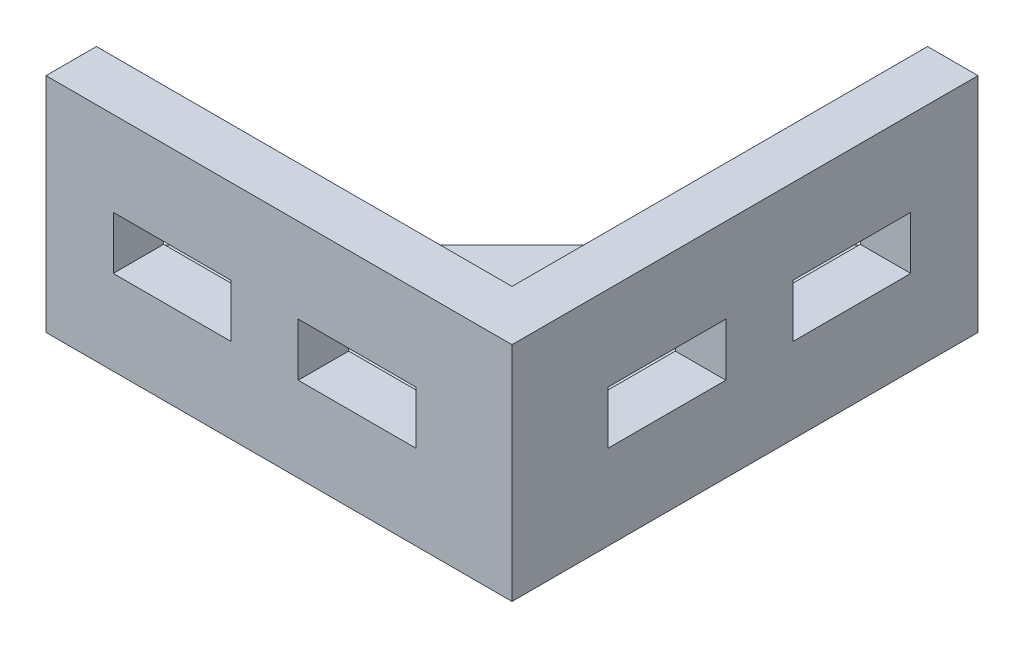
ISO-10303-21;
HEADER;
FILE_DESCRIPTION(('STEP AP214'),'2;1');
FILE_NAME('part.step','',(''),(''),'','','');
FILE_SCHEMA(('AUTOMOTIVE_DESIGN { 1 0 10303 214 1 1 1 1 }'));
ENDSEC;
DATA;
#1=APPLICATION_CONTEXT('core data for automotive mechanical design processes');
#2=APPLICATION_PROTOCOL_DEFINITION('international standard','automotive_design',2000,#1);
#3=PRODUCT_CONTEXT('',#1,'mechanical');
#4=PRODUCT('Part','Part','',(#3));
#5=PRODUCT_RELATED_PRODUCT_CATEGORY('part','',(#4));
#6=PRODUCT_DEFINITION_FORMATION('','',#4);
#7=PRODUCT_DEFINITION_CONTEXT('part definition',#1,'design');
#8=PRODUCT_DEFINITION('design','',#6,#7);
#9=PRODUCT_DEFINITION_SHAPE('','',#8);
#10=(LENGTH_UNIT() NAMED_UNIT(*) SI_UNIT(.MILLI.,.METRE.));
#11=(NAMED_UNIT(*) PLANE_ANGLE_UNIT() SI_UNIT($,.RADIAN.));
#12=(NAMED_UNIT(*) SI_UNIT($,.STERADIAN.) SOLID_ANGLE_UNIT());
#13=UNCERTAINTY_MEASURE_WITH_UNIT(LENGTH_MEASURE(1.E-05),#10,'distance_accuracy_value','');
#14=(GEOMETRIC_REPRESENTATION_CONTEXT(3) GLOBAL_UNCERTAINTY_ASSIGNED_CONTEXT((#13)) GLOBAL_UNIT_ASSIGNED_CONTEXT((#10,
#11,#12)) REPRESENTATION_CONTEXT('',''));
#15=CARTESIAN_POINT('',(0.,0.,0.));
#16=DIRECTION('',(0.,0.,1.));
#17=DIRECTION('',(1.,0.,0.));
#18=AXIS2_PLACEMENT_3D('',#15,#16,#17);
#19=CARTESIAN_POINT('',(-9.52499999999999,42.,-9.52499999999999));
#20=DIRECTION('',(1.,0.,0.));
#21=DIRECTION('',(0.,0.,-1.));
#22=AXIS2_PLACEMENT_3D('',#19,#20,#21);
#23=PLANE('',#22);
#24=DIRECTION('',(0.,0.,-1.));
#25=VECTOR('',#24,1.);
#26=CARTESIAN_POINT('',(-9.52499999999999,26.,-18.15));
#27=LINE('',#26,#25);
#28=CARTESIAN_POINT('',(-9.52499999999999,26.,-18.15));
#29=VERTEX_POINT('',#28);
#30=CARTESIAN_POINT('',(-9.52499999999999,26.,-40.375));
#31=VERTEX_POINT('',#30);
#32=EDGE_CURVE('E231',#29,#31,#27,.T.);
#33=ORIENTED_EDGE('',*,*,#32,.F.);
#34=DIRECTION('',(0.,1.,0.));
#35=VECTOR('',#34,1.);
#36=CARTESIAN_POINT('',(-9.52499999999999,16.,-18.15));
#37=LINE('',#36,#35);
#38=CARTESIAN_POINT('',(-9.52499999999999,16.,-18.15));
#39=VERTEX_POINT('',#38);
#40=EDGE_CURVE('E55',#39,#29,#37,.T.);
#41=ORIENTED_EDGE('',*,*,#40,.F.);
#42=DIRECTION('',(0.,0.,1.));
#43=VECTOR('',#42,1.);
#44=CARTESIAN_POINT('',(-9.52499999999999,16.,-18.15));
#45=LINE('',#44,#43);
#46=CARTESIAN_POINT('',(-9.52499999999999,16.,-40.375));
#47=VERTEX_POINT('',#46);
#48=EDGE_CURVE('E218',#47,#39,#45,.T.);
#49=ORIENTED_EDGE('',*,*,#48,.F.);
#50=DIRECTION('',(0.,-1.,0.));
#51=VECTOR('',#50,1.);
#52=CARTESIAN_POINT('',(-9.52499999999999,16.,-40.375));
#53=LINE('',#52,#51);
#54=EDGE_CURVE('E222',#31,#47,#53,.T.);
#55=ORIENTED_EDGE('',*,*,#54,.F.);
#56=EDGE_LOOP('',(#33,#41,#49,#55));
#57=FACE_BOUND('',#56,.T.);
#58=DIRECTION('',(0.,0.,-1.));
#59=VECTOR('',#58,1.);
#60=CARTESIAN_POINT('',(-9.52499999999999,26.,-53.075));
#61=LINE('',#60,#59);
#62=CARTESIAN_POINT('',(-9.52499999999999,26.,-53.075));
#63=VERTEX_POINT('',#62);
#64=CARTESIAN_POINT('',(-9.52499999999999,26.,-75.3));
#65=VERTEX_POINT('',#64);
#66=EDGE_CURVE('E267',#63,#65,#61,.T.);
#67=ORIENTED_EDGE('',*,*,#66,.F.);
#68=DIRECTION('',(0.,1.,0.));
#69=VECTOR('',#68,1.);
#70=CARTESIAN_POINT('',(-9.52499999999999,16.,-53.075));
#71=LINE('',#70,#69);
#72=CARTESIAN_POINT('',(-9.52499999999999,16.,-53.075));
#73=VERTEX_POINT('',#72);
#74=EDGE_CURVE('E63',#73,#63,#71,.T.);
#75=ORIENTED_EDGE('',*,*,#74,.F.);
#76=DIRECTION('',(0.,0.,1.));
#77=VECTOR('',#76,1.);
#78=CARTESIAN_POINT('',(-9.52499999999999,16.,-53.075));
#79=LINE('',#78,#77);
#80=CARTESIAN_POINT('',(-9.52499999999999,16.,-75.3));
#81=VERTEX_POINT('',#80);
#82=EDGE_CURVE('E252',#81,#73,#79,.T.);
#83=ORIENTED_EDGE('',*,*,#82,.F.);
#84=DIRECTION('',(0.,-1.,0.));
#85=VECTOR('',#84,1.);
#86=CARTESIAN_POINT('',(-9.52499999999999,16.,-75.3));
#87=LINE('',#86,#85);
#88=EDGE_CURVE('E271',#65,#81,#87,.T.);
#89=ORIENTED_EDGE('',*,*,#88,.F.);
#90=EDGE_LOOP('',(#67,#75,#83,#89));
#91=FACE_BOUND('',#90,.T.);
#92=DIRECTION('',(0.,0.,-1.));
#93=VECTOR('',#92,1.);
#94=CARTESIAN_POINT('',(-9.52499999999999,9.525,-9.52499999999999));
#95=LINE('',#94,#93);
#96=CARTESIAN_POINT('',(-9.52499999999999,9.52500000000001,-9.52499999999999));
#97=VERTEX_POINT('',#96);
#98=CARTESIAN_POINT('',(-9.52499999999999,9.52500000000001,-88.));
#99=VERTEX_POINT('',#98);
#100=EDGE_CURVE('E376',#97,#99,#95,.T.);
#101=ORIENTED_EDGE('',*,*,#100,.F.);
#102=DIRECTION('',(0.,-1.,0.));
#103=VECTOR('',#102,1.);
#104=CARTESIAN_POINT('',(-9.52499999999999,42.,-9.52499999999999));
#105=LINE('',#104,#103);
#106=CARTESIAN_POINT('',(-9.52499999999999,42.,-9.52499999999999));
#107=VERTEX_POINT('',#106);
#108=EDGE_CURVE('E443',#107,#97,#105,.T.);
#109=ORIENTED_EDGE('',*,*,#108,.F.);
#110=DIRECTION('',(0.,0.,1.));
#111=VECTOR('',#110,1.);
#112=CARTESIAN_POINT('',(-9.52499999999999,42.,-9.52499999999999));
#113=LINE('',#112,#111);
#114=CARTESIAN_POINT('',(-9.52499999999999,42.,-88.));
#115=VERTEX_POINT('',#114);
#116=EDGE_CURVE('E408',#115,#107,#113,.T.);
#117=ORIENTED_EDGE('',*,*,#116,.F.);
#118=DIRECTION('',(0.,-1.,0.));
#119=VECTOR('',#118,1.);
#120=CARTESIAN_POINT('',(-9.52499999999999,42.,-88.));
#121=LINE('',#120,#119);
#122=EDGE_CURVE('E48',#115,#99,#121,.T.);
#123=ORIENTED_EDGE('',*,*,#122,.T.);
#124=EDGE_LOOP('',(#101,#109,#117,#123));
#125=FACE_BOUND('',#124,.T.);
#126=ADVANCED_FACE('F39',(#57,#91,#125),#23,.F.);
#127=CARTESIAN_POINT('',(-88.,42.,-9.52499999999999));
#128=DIRECTION('',(0.,0.,1.));
#129=DIRECTION('',(1.,0.,0.));
#130=AXIS2_PLACEMENT_3D('',#127,#128,#129);
#131=PLANE('',#130);
#132=DIRECTION('',(0.,-1.,0.));
#133=VECTOR('',#132,1.);
#134=CARTESIAN_POINT('',(-18.15,26.,-9.52499999999999));
#135=LINE('',#134,#133);
#136=CARTESIAN_POINT('',(-18.15,26.,-9.52499999999999));
#137=VERTEX_POINT('',#136);
#138=CARTESIAN_POINT('',(-18.15,16.,-9.52499999999999));
#139=VERTEX_POINT('',#138);
#140=EDGE_CURVE('E309',#137,#139,#135,.T.);
#141=ORIENTED_EDGE('',*,*,#140,.F.);
#142=DIRECTION('',(1.,0.,0.));
#143=VECTOR('',#142,1.);
#144=CARTESIAN_POINT('',(-40.375,26.,-9.52499999999999));
#145=LINE('',#144,#143);
#146=CARTESIAN_POINT('',(-40.375,26.,-9.52499999999999));
#147=VERTEX_POINT('',#146);
#148=EDGE_CURVE('E306',#147,#137,#145,.T.);
#149=ORIENTED_EDGE('',*,*,#148,.F.);
#150=DIRECTION('',(0.,1.,0.));
#151=VECTOR('',#150,1.);
#152=CARTESIAN_POINT('',(-40.375,16.,-9.52499999999999));
#153=LINE('',#152,#151);
#154=CARTESIAN_POINT('',(-40.375,16.,-9.52499999999999));
#155=VERTEX_POINT('',#154);
#156=EDGE_CURVE('E293',#155,#147,#153,.T.);
#157=ORIENTED_EDGE('',*,*,#156,.F.);
#158=DIRECTION('',(-1.,0.,0.));
#159=VECTOR('',#158,1.);
#160=CARTESIAN_POINT('',(-18.15,16.,-9.52499999999999));
#161=LINE('',#160,#159);
#162=EDGE_CURVE('E314',#139,#155,#161,.T.);
#163=ORIENTED_EDGE('',*,*,#162,.F.);
#164=EDGE_LOOP('',(#141,#149,#157,#163));
#165=FACE_BOUND('',#164,.T.);
#166=DIRECTION('',(-1.,0.,0.));
#167=VECTOR('',#166,1.);
#168=CARTESIAN_POINT('',(-53.075,16.,-9.52499999999999));
#169=LINE('',#168,#167);
#170=CARTESIAN_POINT('',(-53.075,16.,-9.52499999999999));
#171=VERTEX_POINT('',#170);
#172=CARTESIAN_POINT('',(-75.3,16.,-9.52499999999999));
#173=VERTEX_POINT('',#172);
#174=EDGE_CURVE('E354',#171,#173,#169,.T.);
#175=ORIENTED_EDGE('',*,*,#174,.F.);
#176=DIRECTION('',(0.,-1.,0.));
#177=VECTOR('',#176,1.);
#178=CARTESIAN_POINT('',(-53.075,26.,-9.52499999999999));
#179=LINE('',#178,#177);
#180=CARTESIAN_POINT('',(-53.075,26.,-9.52499999999999));
#181=VERTEX_POINT('',#180);
#182=EDGE_CURVE('E241',#181,#171,#179,.T.);
#183=ORIENTED_EDGE('',*,*,#182,.F.);
#184=DIRECTION('',(1.,0.,0.));
#185=VECTOR('',#184,1.);
#186=CARTESIAN_POINT('',(-53.075,26.,-9.52499999999999));
#187=LINE('',#186,#185);
#188=CARTESIAN_POINT('',(-75.3,26.,-9.52499999999999));
#189=VERTEX_POINT('',#188);
#190=EDGE_CURVE('E339',#189,#181,#187,.T.);
#191=ORIENTED_EDGE('',*,*,#190,.F.);
#192=DIRECTION('',(0.,1.,0.));
#193=VECTOR('',#192,1.);
#194=CARTESIAN_POINT('',(-75.3,26.,-9.52499999999999));
#195=LINE('',#194,#193);
#196=EDGE_CURVE('E358',#173,#189,#195,.T.);
#197=ORIENTED_EDGE('',*,*,#196,.F.);
#198=EDGE_LOOP('',(#175,#183,#191,#197));
#199=FACE_BOUND('',#198,.T.);
#200=DIRECTION('',(1.,0.,0.));
#201=VECTOR('',#200,1.);
#202=CARTESIAN_POINT('',(-88.,9.525,-9.52499999999999));
#203=LINE('',#202,#201);
#204=CARTESIAN_POINT('',(-88.,9.52500000000001,-9.52499999999999));
#205=VERTEX_POINT('',#204);
#206=EDGE_CURVE('E384',#205,#97,#203,.T.);
#207=ORIENTED_EDGE('',*,*,#206,.F.);
#208=DIRECTION('',(0.,-1.,0.));
#209=VECTOR('',#208,1.);
#210=CARTESIAN_POINT('',(-88.,42.,-9.52499999999999));
#211=LINE('',#210,#209);
#212=CARTESIAN_POINT('',(-88.,42.,-9.52499999999999));
#213=VERTEX_POINT('',#212);
#214=EDGE_CURVE('E439',#213,#205,#211,.T.);
#215=ORIENTED_EDGE('',*,*,#214,.F.);
#216=DIRECTION('',(-1.,0.,0.));
#217=VECTOR('',#216,1.);
#218=CARTESIAN_POINT('',(-88.,42.,-9.52499999999999));
#219=LINE('',#218,#217);
#220=EDGE_CURVE('E411',#107,#213,#219,.T.);
#221=ORIENTED_EDGE('',*,*,#220,.F.);
#222=ORIENTED_EDGE('',*,*,#108,.T.);
#223=EDGE_LOOP('',(#207,#215,#221,#222));
#224=FACE_BOUND('',#223,.T.);
#225=ADVANCED_FACE('F461',(#165,#199,#224),#131,.F.);
#226=CARTESIAN_POINT('',(0.,42.,-88.));
#227=DIRECTION('',(-1.,0.,0.));
#228=DIRECTION('',(0.,0.,1.));
#229=AXIS2_PLACEMENT_3D('',#226,#227,#228);
#230=PLANE('',#229);
#231=DIRECTION('',(0.,0.,1.));
#232=VECTOR('',#231,1.);
#233=CARTESIAN_POINT('',(0.,16.,-18.15));
#234=LINE('',#233,#232);
#235=CARTESIAN_POINT('',(0.,16.,-40.375));
#236=VERTEX_POINT('',#235);
#237=CARTESIAN_POINT('',(0.,16.,-18.15));
#238=VERTEX_POINT('',#237);
#239=EDGE_CURVE('E204',#236,#238,#234,.T.);
#240=ORIENTED_EDGE('',*,*,#239,.T.);
#241=DIRECTION('',(0.,1.,0.));
#242=VECTOR('',#241,1.);
#243=CARTESIAN_POINT('',(0.,16.,-18.15));
#244=LINE('',#243,#242);
#245=CARTESIAN_POINT('',(0.,26.,-18.15));
#246=VERTEX_POINT('',#245);
#247=EDGE_CURVE('E197',#238,#246,#244,.T.);
#248=ORIENTED_EDGE('',*,*,#247,.T.);
#249=DIRECTION('',(0.,0.,-1.));
#250=VECTOR('',#249,1.);
#251=CARTESIAN_POINT('',(0.,26.,-18.15));
#252=LINE('',#251,#250);
#253=CARTESIAN_POINT('',(0.,26.,-40.375));
#254=VERTEX_POINT('',#253);
#255=EDGE_CURVE('E208',#246,#254,#252,.T.);
#256=ORIENTED_EDGE('',*,*,#255,.T.);
#257=DIRECTION('',(0.,-1.,0.));
#258=VECTOR('',#257,1.);
#259=CARTESIAN_POINT('',(0.,16.,-40.375));
#260=LINE('',#259,#258);
#261=EDGE_CURVE('E213',#254,#236,#260,.T.);
#262=ORIENTED_EDGE('',*,*,#261,.T.);
#263=EDGE_LOOP('',(#240,#248,#256,#262));
#264=FACE_BOUND('',#263,.T.);
#265=DIRECTION('',(0.,0.,1.));
#266=VECTOR('',#265,1.);
#267=CARTESIAN_POINT('',(0.,16.,-53.075));
#268=LINE('',#267,#266);
#269=CARTESIAN_POINT('',(0.,16.,-75.3));
#270=VERTEX_POINT('',#269);
#271=CARTESIAN_POINT('',(0.,16.,-53.075));
#272=VERTEX_POINT('',#271);
#273=EDGE_CURVE('E260',#270,#272,#268,.T.);
#274=ORIENTED_EDGE('',*,*,#273,.T.);
#275=DIRECTION('',(0.,1.,0.));
#276=VECTOR('',#275,1.);
#277=CARTESIAN_POINT('',(0.,16.,-53.075));
#278=LINE('',#277,#276);
#279=CARTESIAN_POINT('',(0.,26.,-53.075));
#280=VERTEX_POINT('',#279);
#281=EDGE_CURVE('E247',#272,#280,#278,.T.);
#282=ORIENTED_EDGE('',*,*,#281,.T.);
#283=DIRECTION('',(0.,0.,-1.));
#284=VECTOR('',#283,1.);
#285=CARTESIAN_POINT('',(0.,26.,-53.075));
#286=LINE('',#285,#284);
#287=CARTESIAN_POINT('',(0.,26.,-75.3));
#288=VERTEX_POINT('',#287);
#289=EDGE_CURVE('E251',#280,#288,#286,.T.);
#290=ORIENTED_EDGE('',*,*,#289,.T.);
#291=DIRECTION('',(0.,-1.,0.));
#292=VECTOR('',#291,1.);
#293=CARTESIAN_POINT('',(0.,16.,-75.3));
#294=LINE('',#293,#292);
#295=EDGE_CURVE('E256',#288,#270,#294,.T.);
#296=ORIENTED_EDGE('',*,*,#295,.T.);
#297=EDGE_LOOP('',(#274,#282,#290,#296));
#298=FACE_BOUND('',#297,.T.);
#299=DIRECTION('',(0.,0.,-1.));
#300=VECTOR('',#299,1.);
#301=CARTESIAN_POINT('',(0.,0.,-88.));
#302=LINE('',#301,#300);
#303=CARTESIAN_POINT('',(0.,0.,0.));
#304=VERTEX_POINT('',#303);
#305=CARTESIAN_POINT('',(0.,0.,-88.));
#306=VERTEX_POINT('',#305);
#307=EDGE_CURVE('E399',#304,#306,#302,.T.);
#308=ORIENTED_EDGE('',*,*,#307,.T.);
#309=DIRECTION('',(0.,-1.,0.));
#310=VECTOR('',#309,1.);
#311=CARTESIAN_POINT('',(0.,42.,-88.));
#312=LINE('',#311,#310);
#313=CARTESIAN_POINT('',(0.,42.,-88.));
#314=VERTEX_POINT('',#313);
#315=EDGE_CURVE('E11',#314,#306,#312,.T.);
#316=ORIENTED_EDGE('',*,*,#315,.F.);
#317=DIRECTION('',(0.,0.,-1.));
#318=VECTOR('',#317,1.);
#319=CARTESIAN_POINT('',(0.,42.,-88.));
#320=LINE('',#319,#318);
#321=CARTESIAN_POINT('',(0.,42.,0.));
#322=VERTEX_POINT('',#321);
#323=EDGE_CURVE('E400',#322,#314,#320,.T.);
#324=ORIENTED_EDGE('',*,*,#323,.F.);
#325=DIRECTION('',(0.,-1.,0.));
#326=VECTOR('',#325,1.);
#327=CARTESIAN_POINT('',(0.,42.,0.));
#328=LINE('',#327,#326);
#329=EDGE_CURVE('E420',#322,#304,#328,.T.);
#330=ORIENTED_EDGE('',*,*,#329,.T.);
#331=EDGE_LOOP('',(#308,#316,#324,#330));
#332=FACE_BOUND('',#331,.T.);
#333=ADVANCED_FACE('F41',(#264,#298,#332),#230,.F.);
#334=CARTESIAN_POINT('',(-9.52499999999999,42.,-88.));
#335=DIRECTION('',(0.,0.,1.));
#336=DIRECTION('',(1.,0.,0.));
#337=AXIS2_PLACEMENT_3D('',#334,#335,#336);
#338=PLANE('',#337);
#339=DIRECTION('',(-1.,0.,0.));
#340=VECTOR('',#339,1.);
#341=CARTESIAN_POINT('',(-9.52499999999999,0.,-88.));
#342=LINE('',#341,#340);
#343=CARTESIAN_POINT('',(-9.52499999999999,0.,-88.));
#344=VERTEX_POINT('',#343);
#345=EDGE_CURVE('E424',#306,#344,#342,.T.);
#346=ORIENTED_EDGE('',*,*,#345,.T.);
#347=DIRECTION('',(0.,-1.,0.));
#348=VECTOR('',#347,1.);
#349=CARTESIAN_POINT('',(-9.52499999999999,9.525,-88.));
#350=LINE('',#349,#348);
#351=EDGE_CURVE('E395',#99,#344,#350,.T.);
#352=ORIENTED_EDGE('',*,*,#351,.F.);
#353=ORIENTED_EDGE('',*,*,#122,.F.);
#354=DIRECTION('',(-1.,0.,0.));
#355=VECTOR('',#354,1.);
#356=CARTESIAN_POINT('',(-9.52499999999999,42.,-88.));
#357=LINE('',#356,#355);
#358=EDGE_CURVE('E404',#314,#115,#357,.T.);
#359=ORIENTED_EDGE('',*,*,#358,.F.);
#360=ORIENTED_EDGE('',*,*,#315,.T.);
#361=EDGE_LOOP('',(#346,#352,#353,#359,#360));
#362=FACE_BOUND('',#361,.T.);
#363=ADVANCED_FACE('F473',(#362),#338,.F.);
#364=CARTESIAN_POINT('',(-88.,42.,0.));
#365=DIRECTION('',(1.,0.,0.));
#366=DIRECTION('',(0.,0.,-1.));
#367=AXIS2_PLACEMENT_3D('',#364,#365,#366);
#368=PLANE('',#367);
#369=DIRECTION('',(0.,0.,1.));
#370=VECTOR('',#369,1.);
#371=CARTESIAN_POINT('',(-88.,0.,0.));
#372=LINE('',#371,#370);
#373=CARTESIAN_POINT('',(-88.,0.,-9.52499999999999));
#374=VERTEX_POINT('',#373);
#375=CARTESIAN_POINT('',(-88.,0.,0.));
#376=VERTEX_POINT('',#375);
#377=EDGE_CURVE('E427',#374,#376,#372,.T.);
#378=ORIENTED_EDGE('',*,*,#377,.T.);
#379=DIRECTION('',(0.,-1.,0.));
#380=VECTOR('',#379,1.);
#381=CARTESIAN_POINT('',(-88.,42.,0.));
#382=LINE('',#381,#380);
#383=CARTESIAN_POINT('',(-88.,42.,0.));
#384=VERTEX_POINT('',#383);
#385=EDGE_CURVE('E435',#384,#376,#382,.T.);
#386=ORIENTED_EDGE('',*,*,#385,.F.);
#387=DIRECTION('',(0.,0.,1.));
#388=VECTOR('',#387,1.);
#389=CARTESIAN_POINT('',(-88.,42.,0.));
#390=LINE('',#389,#388);
#391=EDGE_CURVE('E414',#213,#384,#390,.T.);
#392=ORIENTED_EDGE('',*,*,#391,.F.);
#393=ORIENTED_EDGE('',*,*,#214,.T.);
#394=DIRECTION('',(0.,-1.,0.));
#395=VECTOR('',#394,1.);
#396=CARTESIAN_POINT('',(-88.,9.525,-9.52499999999999));
#397=LINE('',#396,#395);
#398=EDGE_CURVE('E388',#205,#374,#397,.T.);
#399=ORIENTED_EDGE('',*,*,#398,.T.);
#400=EDGE_LOOP('',(#378,#386,#392,#393,#399));
#401=FACE_BOUND('',#400,.T.);
#402=ADVANCED_FACE('F465',(#401),#368,.F.);
#403=CARTESIAN_POINT('',(0.,42.,0.));
#404=DIRECTION('',(0.,0.,-1.));
#405=DIRECTION('',(-1.,0.,0.));
#406=AXIS2_PLACEMENT_3D('',#403,#404,#405);
#407=PLANE('',#406);
#408=DIRECTION('',(0.,1.,0.));
#409=VECTOR('',#408,1.);
#410=CARTESIAN_POINT('',(-40.375,16.,0.));
#411=LINE('',#410,#409);
#412=CARTESIAN_POINT('',(-40.375,16.,0.));
#413=VERTEX_POINT('',#412);
#414=CARTESIAN_POINT('',(-40.375,26.,0.));
#415=VERTEX_POINT('',#414);
#416=EDGE_CURVE('E301',#413,#415,#411,.T.);
#417=ORIENTED_EDGE('',*,*,#416,.T.);
#418=DIRECTION('',(1.,0.,0.));
#419=VECTOR('',#418,1.);
#420=CARTESIAN_POINT('',(-40.375,26.,0.));
#421=LINE('',#420,#419);
#422=CARTESIAN_POINT('',(-18.15,26.,0.));
#423=VERTEX_POINT('',#422);
#424=EDGE_CURVE('E288',#415,#423,#421,.T.);
#425=ORIENTED_EDGE('',*,*,#424,.T.);
#426=DIRECTION('',(0.,-1.,0.));
#427=VECTOR('',#426,1.);
#428=CARTESIAN_POINT('',(-18.15,26.,0.));
#429=LINE('',#428,#427);
#430=CARTESIAN_POINT('',(-18.15,16.,0.));
#431=VERTEX_POINT('',#430);
#432=EDGE_CURVE('E292',#423,#431,#429,.T.);
#433=ORIENTED_EDGE('',*,*,#432,.T.);
#434=DIRECTION('',(-1.,0.,0.));
#435=VECTOR('',#434,1.);
#436=CARTESIAN_POINT('',(-18.15,16.,0.));
#437=LINE('',#436,#435);
#438=EDGE_CURVE('E297',#431,#413,#437,.T.);
#439=ORIENTED_EDGE('',*,*,#438,.T.);
#440=EDGE_LOOP('',(#417,#425,#433,#439));
#441=FACE_BOUND('',#440,.T.);
#442=DIRECTION('',(1.,0.,0.));
#443=VECTOR('',#442,1.);
#444=CARTESIAN_POINT('',(-53.075,26.,0.));
#445=LINE('',#444,#443);
#446=CARTESIAN_POINT('',(-75.3,26.,0.));
#447=VERTEX_POINT('',#446);
#448=CARTESIAN_POINT('',(-53.075,26.,0.));
#449=VERTEX_POINT('',#448);
#450=EDGE_CURVE('E347',#447,#449,#445,.T.);
#451=ORIENTED_EDGE('',*,*,#450,.T.);
#452=DIRECTION('',(0.,-1.,0.));
#453=VECTOR('',#452,1.);
#454=CARTESIAN_POINT('',(-53.075,26.,0.));
#455=LINE('',#454,#453);
#456=CARTESIAN_POINT('',(-53.075,16.,0.));
#457=VERTEX_POINT('',#456);
#458=EDGE_CURVE('E334',#449,#457,#455,.T.);
#459=ORIENTED_EDGE('',*,*,#458,.T.);
#460=DIRECTION('',(-1.,0.,0.));
#461=VECTOR('',#460,1.);
#462=CARTESIAN_POINT('',(-53.075,16.,0.));
#463=LINE('',#462,#461);
#464=CARTESIAN_POINT('',(-75.3,16.,0.));
#465=VERTEX_POINT('',#464);
#466=EDGE_CURVE('E338',#457,#465,#463,.T.);
#467=ORIENTED_EDGE('',*,*,#466,.T.);
#468=DIRECTION('',(0.,1.,0.));
#469=VECTOR('',#468,1.);
#470=CARTESIAN_POINT('',(-75.3,26.,0.));
#471=LINE('',#470,#469);
#472=EDGE_CURVE('E343',#465,#447,#471,.T.);
#473=ORIENTED_EDGE('',*,*,#472,.T.);
#474=EDGE_LOOP('',(#451,#459,#467,#473));
#475=FACE_BOUND('',#474,.T.);
#476=DIRECTION('',(1.,0.,0.));
#477=VECTOR('',#476,1.);
#478=CARTESIAN_POINT('',(0.,0.,0.));
#479=LINE('',#478,#477);
#480=EDGE_CURVE('E405',#376,#304,#479,.T.);
#481=ORIENTED_EDGE('',*,*,#480,.T.);
#482=ORIENTED_EDGE('',*,*,#329,.F.);
#483=DIRECTION('',(1.,0.,0.));
#484=VECTOR('',#483,1.);
#485=CARTESIAN_POINT('',(0.,42.,0.));
#486=LINE('',#485,#484);
#487=EDGE_CURVE('E417',#384,#322,#486,.T.);
#488=ORIENTED_EDGE('',*,*,#487,.F.);
#489=ORIENTED_EDGE('',*,*,#385,.T.);
#490=EDGE_LOOP('',(#481,#482,#488,#489));
#491=FACE_BOUND('',#490,.T.);
#492=ADVANCED_FACE('F481',(#441,#475,#491),#407,.F.);
#493=CARTESIAN_POINT('',(0.,42.,0.));
#494=DIRECTION('',(0.,-1.,0.));
#495=DIRECTION('',(0.,0.,-1.));
#496=AXIS2_PLACEMENT_3D('',#493,#494,#495);
#497=PLANE('',#496);
#498=ORIENTED_EDGE('',*,*,#323,.T.);
#499=ORIENTED_EDGE('',*,*,#358,.T.);
#500=ORIENTED_EDGE('',*,*,#116,.T.);
#501=ORIENTED_EDGE('',*,*,#220,.T.);
#502=ORIENTED_EDGE('',*,*,#391,.T.);
#503=ORIENTED_EDGE('',*,*,#487,.T.);
#504=EDGE_LOOP('',(#498,#499,#500,#501,#502,#503));
#505=FACE_BOUND('',#504,.T.);
#506=ADVANCED_FACE('F469',(#505),#497,.F.);
#507=CARTESIAN_POINT('',(0.,0.,0.));
#508=DIRECTION('',(0.,-1.,0.));
#509=DIRECTION('',(0.,0.,-1.));
#510=AXIS2_PLACEMENT_3D('',#507,#508,#509);
#511=PLANE('',#510);
#512=ORIENTED_EDGE('',*,*,#307,.F.);
#513=ORIENTED_EDGE('',*,*,#480,.F.);
#514=ORIENTED_EDGE('',*,*,#377,.F.);
#515=DIRECTION('',(-0.707106781186548,0.,0.707106781186548));
#516=VECTOR('',#515,1.);
#517=CARTESIAN_POINT('',(-9.52499999999999,0.,-88.));
#518=LINE('',#517,#516);
#519=EDGE_CURVE('E324',#344,#374,#518,.T.);
#520=ORIENTED_EDGE('',*,*,#519,.F.);
#521=ORIENTED_EDGE('',*,*,#345,.F.);
#522=EDGE_LOOP('',(#512,#513,#514,#520,#521));
#523=FACE_BOUND('',#522,.T.);
#524=ADVANCED_FACE('F479',(#523),#511,.T.);
#525=CARTESIAN_POINT('',(-9.52499999999999,9.525,-88.));
#526=DIRECTION('',(0.707106781186548,0.,0.707106781186548));
#527=DIRECTION('',(0.707106781186548,0.,-0.707106781186548));
#528=AXIS2_PLACEMENT_3D('',#525,#526,#527);
#529=PLANE('',#528);
#530=ORIENTED_EDGE('',*,*,#519,.T.);
#531=ORIENTED_EDGE('',*,*,#398,.F.);
#532=DIRECTION('',(-0.707106781186548,0.,0.707106781186548));
#533=VECTOR('',#532,1.);
#534=CARTESIAN_POINT('',(-9.52499999999999,9.525,-88.));
#535=LINE('',#534,#533);
#536=EDGE_CURVE('E380',#99,#205,#535,.T.);
#537=ORIENTED_EDGE('',*,*,#536,.F.);
#538=ORIENTED_EDGE('',*,*,#351,.T.);
#539=EDGE_LOOP('',(#530,#531,#537,#538));
#540=FACE_BOUND('',#539,.T.);
#541=ADVANCED_FACE('F456',(#540),#529,.F.);
#542=CARTESIAN_POINT('',(0.,9.525,0.));
#543=DIRECTION('',(0.,-1.,0.));
#544=DIRECTION('',(0.,0.,-1.));
#545=AXIS2_PLACEMENT_3D('',#542,#543,#544);
#546=PLANE('',#545);
#547=ORIENTED_EDGE('',*,*,#100,.T.);
#548=ORIENTED_EDGE('',*,*,#536,.T.);
#549=ORIENTED_EDGE('',*,*,#206,.T.);
#550=EDGE_LOOP('',(#547,#548,#549));
#551=FACE_BOUND('',#550,.T.);
#552=ADVANCED_FACE('F458',(#551),#546,.F.);
#553=CARTESIAN_POINT('',(-53.075,26.,0.));
#554=DIRECTION('',(1.,0.,0.));
#555=DIRECTION('',(0.,0.,-1.));
#556=AXIS2_PLACEMENT_3D('',#553,#554,#555);
#557=PLANE('',#556);
#558=ORIENTED_EDGE('',*,*,#182,.T.);
#559=DIRECTION('',(0.,0.,-1.));
#560=VECTOR('',#559,1.);
#561=CARTESIAN_POINT('',(-53.075,16.,0.));
#562=LINE('',#561,#560);
#563=EDGE_CURVE('E351',#457,#171,#562,.T.);
#564=ORIENTED_EDGE('',*,*,#563,.F.);
#565=ORIENTED_EDGE('',*,*,#458,.F.);
#566=DIRECTION('',(0.,0.,-1.));
#567=VECTOR('',#566,1.);
#568=CARTESIAN_POINT('',(-53.075,26.,0.));
#569=LINE('',#568,#567);
#570=EDGE_CURVE('E310',#449,#181,#569,.T.);
#571=ORIENTED_EDGE('',*,*,#570,.T.);
#572=EDGE_LOOP('',(#558,#564,#565,#571));
#573=FACE_BOUND('',#572,.T.);
#574=ADVANCED_FACE('F531',(#573),#557,.F.);
#575=CARTESIAN_POINT('',(-53.075,26.,0.));
#576=DIRECTION('',(0.,1.,0.));
#577=DIRECTION('',(0.,0.,1.));
#578=AXIS2_PLACEMENT_3D('',#575,#576,#577);
#579=PLANE('',#578);
#580=ORIENTED_EDGE('',*,*,#190,.T.);
#581=ORIENTED_EDGE('',*,*,#570,.F.);
#582=ORIENTED_EDGE('',*,*,#450,.F.);
#583=DIRECTION('',(0.,0.,-1.));
#584=VECTOR('',#583,1.);
#585=CARTESIAN_POINT('',(-75.3,26.,0.));
#586=LINE('',#585,#584);
#587=EDGE_CURVE('E367',#447,#189,#586,.T.);
#588=ORIENTED_EDGE('',*,*,#587,.T.);
#589=EDGE_LOOP('',(#580,#581,#582,#588));
#590=FACE_BOUND('',#589,.T.);
#591=ADVANCED_FACE('F536',(#590),#579,.F.);
#592=CARTESIAN_POINT('',(-75.3,26.,0.));
#593=DIRECTION('',(-1.,0.,0.));
#594=DIRECTION('',(0.,0.,1.));
#595=AXIS2_PLACEMENT_3D('',#592,#593,#594);
#596=PLANE('',#595);
#597=ORIENTED_EDGE('',*,*,#196,.T.);
#598=ORIENTED_EDGE('',*,*,#587,.F.);
#599=ORIENTED_EDGE('',*,*,#472,.F.);
#600=DIRECTION('',(0.,0.,-1.));
#601=VECTOR('',#600,1.);
#602=CARTESIAN_POINT('',(-75.3,16.,0.));
#603=LINE('',#602,#601);
#604=EDGE_CURVE('E370',#465,#173,#603,.T.);
#605=ORIENTED_EDGE('',*,*,#604,.T.);
#606=EDGE_LOOP('',(#597,#598,#599,#605));
#607=FACE_BOUND('',#606,.T.);
#608=ADVANCED_FACE('F546',(#607),#596,.F.);
#609=CARTESIAN_POINT('',(-53.075,16.,0.));
#610=DIRECTION('',(0.,-1.,0.));
#611=DIRECTION('',(1.,0.,0.));
#612=AXIS2_PLACEMENT_3D('',#609,#610,#611);
#613=PLANE('',#612);
#614=ORIENTED_EDGE('',*,*,#174,.T.);
#615=ORIENTED_EDGE('',*,*,#604,.F.);
#616=ORIENTED_EDGE('',*,*,#466,.F.);
#617=ORIENTED_EDGE('',*,*,#563,.T.);
#618=EDGE_LOOP('',(#614,#615,#616,#617));
#619=FACE_BOUND('',#618,.T.);
#620=ADVANCED_FACE('F556',(#619),#613,.F.);
#621=CARTESIAN_POINT('',(-40.375,26.,0.));
#622=DIRECTION('',(0.,1.,0.));
#623=DIRECTION('',(0.,0.,1.));
#624=AXIS2_PLACEMENT_3D('',#621,#622,#623);
#625=PLANE('',#624);
#626=ORIENTED_EDGE('',*,*,#148,.T.);
#627=DIRECTION('',(0.,0.,-1.));
#628=VECTOR('',#627,1.);
#629=CARTESIAN_POINT('',(-18.15,26.,0.));
#630=LINE('',#629,#628);
#631=EDGE_CURVE('E305',#423,#137,#630,.T.);
#632=ORIENTED_EDGE('',*,*,#631,.F.);
#633=ORIENTED_EDGE('',*,*,#424,.F.);
#634=DIRECTION('',(0.,0.,-1.));
#635=VECTOR('',#634,1.);
#636=CARTESIAN_POINT('',(-40.375,26.,0.));
#637=LINE('',#636,#635);
#638=EDGE_CURVE('E321',#415,#147,#637,.T.);
#639=ORIENTED_EDGE('',*,*,#638,.T.);
#640=EDGE_LOOP('',(#626,#632,#633,#639));
#641=FACE_BOUND('',#640,.T.);
#642=ADVANCED_FACE('F566',(#641),#625,.F.);
#643=CARTESIAN_POINT('',(-40.375,16.,0.));
#644=DIRECTION('',(-1.,0.,0.));
#645=DIRECTION('',(0.,0.,1.));
#646=AXIS2_PLACEMENT_3D('',#643,#644,#645);
#647=PLANE('',#646);
#648=ORIENTED_EDGE('',*,*,#156,.T.);
#649=ORIENTED_EDGE('',*,*,#638,.F.);
#650=ORIENTED_EDGE('',*,*,#416,.F.);
#651=DIRECTION('',(0.,0.,-1.));
#652=VECTOR('',#651,1.);
#653=CARTESIAN_POINT('',(-40.375,16.,0.));
#654=LINE('',#653,#652);
#655=EDGE_CURVE('E325',#413,#155,#654,.T.);
#656=ORIENTED_EDGE('',*,*,#655,.T.);
#657=EDGE_LOOP('',(#648,#649,#650,#656));
#658=FACE_BOUND('',#657,.T.);
#659=ADVANCED_FACE('F576',(#658),#647,.F.);
#660=CARTESIAN_POINT('',(-18.15,16.,0.));
#661=DIRECTION('',(0.,-1.,0.));
#662=DIRECTION('',(1.,0.,0.));
#663=AXIS2_PLACEMENT_3D('',#660,#661,#662);
#664=PLANE('',#663);
#665=ORIENTED_EDGE('',*,*,#162,.T.);
#666=ORIENTED_EDGE('',*,*,#655,.F.);
#667=ORIENTED_EDGE('',*,*,#438,.F.);
#668=DIRECTION('',(0.,0.,-1.));
#669=VECTOR('',#668,1.);
#670=CARTESIAN_POINT('',(-18.15,16.,0.));
#671=LINE('',#670,#669);
#672=EDGE_CURVE('E328',#431,#139,#671,.T.);
#673=ORIENTED_EDGE('',*,*,#672,.T.);
#674=EDGE_LOOP('',(#665,#666,#667,#673));
#675=FACE_BOUND('',#674,.T.);
#676=ADVANCED_FACE('F586',(#675),#664,.F.);
#677=CARTESIAN_POINT('',(-18.15,26.,0.));
#678=DIRECTION('',(1.,0.,0.));
#679=DIRECTION('',(0.,0.,-1.));
#680=AXIS2_PLACEMENT_3D('',#677,#678,#679);
#681=PLANE('',#680);
#682=ORIENTED_EDGE('',*,*,#140,.T.);
#683=ORIENTED_EDGE('',*,*,#672,.F.);
#684=ORIENTED_EDGE('',*,*,#432,.F.);
#685=ORIENTED_EDGE('',*,*,#631,.T.);
#686=EDGE_LOOP('',(#682,#683,#684,#685));
#687=FACE_BOUND('',#686,.T.);
#688=ADVANCED_FACE('F596',(#687),#681,.F.);
#689=CARTESIAN_POINT('',(0.,16.,-53.075));
#690=DIRECTION('',(0.,0.,1.));
#691=DIRECTION('',(1.,0.,0.));
#692=AXIS2_PLACEMENT_3D('',#689,#690,#691);
#693=PLANE('',#692);
#694=ORIENTED_EDGE('',*,*,#74,.T.);
#695=DIRECTION('',(-1.,0.,0.));
#696=VECTOR('',#695,1.);
#697=CARTESIAN_POINT('',(0.,26.,-53.075));
#698=LINE('',#697,#696);
#699=EDGE_CURVE('E264',#280,#63,#698,.T.);
#700=ORIENTED_EDGE('',*,*,#699,.F.);
#701=ORIENTED_EDGE('',*,*,#281,.F.);
#702=DIRECTION('',(-1.,0.,0.));
#703=VECTOR('',#702,1.);
#704=CARTESIAN_POINT('',(0.,16.,-53.075));
#705=LINE('',#704,#703);
#706=EDGE_CURVE('E232',#272,#73,#705,.T.);
#707=ORIENTED_EDGE('',*,*,#706,.T.);
#708=EDGE_LOOP('',(#694,#700,#701,#707));
#709=FACE_BOUND('',#708,.T.);
#710=ADVANCED_FACE('F605',(#709),#693,.F.);
#711=CARTESIAN_POINT('',(0.,16.,-53.075));
#712=DIRECTION('',(0.,-1.,0.));
#713=DIRECTION('',(0.,0.,-1.));
#714=AXIS2_PLACEMENT_3D('',#711,#712,#713);
#715=PLANE('',#714);
#716=ORIENTED_EDGE('',*,*,#82,.T.);
#717=ORIENTED_EDGE('',*,*,#706,.F.);
#718=ORIENTED_EDGE('',*,*,#273,.F.);
#719=DIRECTION('',(-1.,0.,0.));
#720=VECTOR('',#719,1.);
#721=CARTESIAN_POINT('',(0.,16.,-75.3));
#722=LINE('',#721,#720);
#723=EDGE_CURVE('E280',#270,#81,#722,.T.);
#724=ORIENTED_EDGE('',*,*,#723,.T.);
#725=EDGE_LOOP('',(#716,#717,#718,#724));
#726=FACE_BOUND('',#725,.T.);
#727=ADVANCED_FACE('F637',(#726),#715,.F.);
#728=CARTESIAN_POINT('',(0.,16.,-75.3));
#729=DIRECTION('',(0.,0.,-1.));
#730=DIRECTION('',(-1.,0.,0.));
#731=AXIS2_PLACEMENT_3D('',#728,#729,#730);
#732=PLANE('',#731);
#733=ORIENTED_EDGE('',*,*,#88,.T.);
#734=ORIENTED_EDGE('',*,*,#723,.F.);
#735=ORIENTED_EDGE('',*,*,#295,.F.);
#736=DIRECTION('',(-1.,0.,0.));
#737=VECTOR('',#736,1.);
#738=CARTESIAN_POINT('',(0.,26.,-75.3));
#739=LINE('',#738,#737);
#740=EDGE_CURVE('E283',#288,#65,#739,.T.);
#741=ORIENTED_EDGE('',*,*,#740,.T.);
#742=EDGE_LOOP('',(#733,#734,#735,#741));
#743=FACE_BOUND('',#742,.T.);
#744=ADVANCED_FACE('F641',(#743),#732,.F.);
#745=CARTESIAN_POINT('',(0.,26.,-53.075));
#746=DIRECTION('',(0.,1.,0.));
#747=DIRECTION('',(0.,0.,1.));
#748=AXIS2_PLACEMENT_3D('',#745,#746,#747);
#749=PLANE('',#748);
#750=ORIENTED_EDGE('',*,*,#66,.T.);
#751=ORIENTED_EDGE('',*,*,#740,.F.);
#752=ORIENTED_EDGE('',*,*,#289,.F.);
#753=ORIENTED_EDGE('',*,*,#699,.T.);
#754=EDGE_LOOP('',(#750,#751,#752,#753));
#755=FACE_BOUND('',#754,.T.);
#756=ADVANCED_FACE('F638',(#755),#749,.F.);
#757=CARTESIAN_POINT('',(0.,16.,-18.15));
#758=DIRECTION('',(0.,0.,1.));
#759=DIRECTION('',(1.,0.,0.));
#760=AXIS2_PLACEMENT_3D('',#757,#758,#759);
#761=PLANE('',#760);
#762=ORIENTED_EDGE('',*,*,#40,.T.);
#763=DIRECTION('',(-1.,0.,0.));
#764=VECTOR('',#763,1.);
#765=CARTESIAN_POINT('',(0.,26.,-18.15));
#766=LINE('',#765,#764);
#767=EDGE_CURVE('E193',#246,#29,#766,.T.);
#768=ORIENTED_EDGE('',*,*,#767,.F.);
#769=ORIENTED_EDGE('',*,*,#247,.F.);
#770=DIRECTION('',(-1.,0.,0.));
#771=VECTOR('',#770,1.);
#772=CARTESIAN_POINT('',(0.,16.,-18.15));
#773=LINE('',#772,#771);
#774=EDGE_CURVE('E238',#238,#39,#773,.T.);
#775=ORIENTED_EDGE('',*,*,#774,.T.);
#776=EDGE_LOOP('',(#762,#768,#769,#775));
#777=FACE_BOUND('',#776,.T.);
#778=ADVANCED_FACE('F195',(#777),#761,.F.);
#779=CARTESIAN_POINT('',(0.,16.,-18.15));
#780=DIRECTION('',(0.,-1.,0.));
#781=DIRECTION('',(0.,0.,-1.));
#782=AXIS2_PLACEMENT_3D('',#779,#780,#781);
#783=PLANE('',#782);
#784=ORIENTED_EDGE('',*,*,#48,.T.);
#785=ORIENTED_EDGE('',*,*,#774,.F.);
#786=ORIENTED_EDGE('',*,*,#239,.F.);
#787=DIRECTION('',(-1.,0.,0.));
#788=VECTOR('',#787,1.);
#789=CARTESIAN_POINT('',(0.,16.,-40.375));
#790=LINE('',#789,#788);
#791=EDGE_CURVE('E242',#236,#47,#790,.T.);
#792=ORIENTED_EDGE('',*,*,#791,.T.);
#793=EDGE_LOOP('',(#784,#785,#786,#792));
#794=FACE_BOUND('',#793,.T.);
#795=ADVANCED_FACE('F651',(#794),#783,.F.);
#796=CARTESIAN_POINT('',(0.,16.,-40.375));
#797=DIRECTION('',(0.,0.,-1.));
#798=DIRECTION('',(-1.,0.,0.));
#799=AXIS2_PLACEMENT_3D('',#796,#797,#798);
#800=PLANE('',#799);
#801=ORIENTED_EDGE('',*,*,#54,.T.);
#802=ORIENTED_EDGE('',*,*,#791,.F.);
#803=ORIENTED_EDGE('',*,*,#261,.F.);
#804=DIRECTION('',(-1.,0.,0.));
#805=VECTOR('',#804,1.);
#806=CARTESIAN_POINT('',(0.,26.,-40.375));
#807=LINE('',#806,#805);
#808=EDGE_CURVE('E203',#254,#31,#807,.T.);
#809=ORIENTED_EDGE('',*,*,#808,.T.);
#810=EDGE_LOOP('',(#801,#802,#803,#809));
#811=FACE_BOUND('',#810,.T.);
#812=ADVANCED_FACE('F654',(#811),#800,.F.);
#813=CARTESIAN_POINT('',(0.,26.,-18.15));
#814=DIRECTION('',(0.,1.,0.));
#815=DIRECTION('',(0.,0.,1.));
#816=AXIS2_PLACEMENT_3D('',#813,#814,#815);
#817=PLANE('',#816);
#818=ORIENTED_EDGE('',*,*,#32,.T.);
#819=ORIENTED_EDGE('',*,*,#808,.F.);
#820=ORIENTED_EDGE('',*,*,#255,.F.);
#821=ORIENTED_EDGE('',*,*,#767,.T.);
#822=EDGE_LOOP('',(#818,#819,#820,#821));
#823=FACE_BOUND('',#822,.T.);
#824=ADVANCED_FACE('F209',(#823),#817,.F.);
#825=CLOSED_SHELL('',(#126,#225,#333,#363,#402,#492,#506,#524,#541,#552,#574,#591,#608,#620,
#642,#659,#676,#688,#710,#727,#744,#756,#778,#795,#812,#824));
#826=MANIFOLD_SOLID_BREP('B2',#825);
#827=ADVANCED_BREP_SHAPE_REPRESENTATION('',(#18,#826),#14);
#828=SHAPE_DEFINITION_REPRESENTATION(#9,#827);
ENDSEC;
END-ISO-10303-21;
